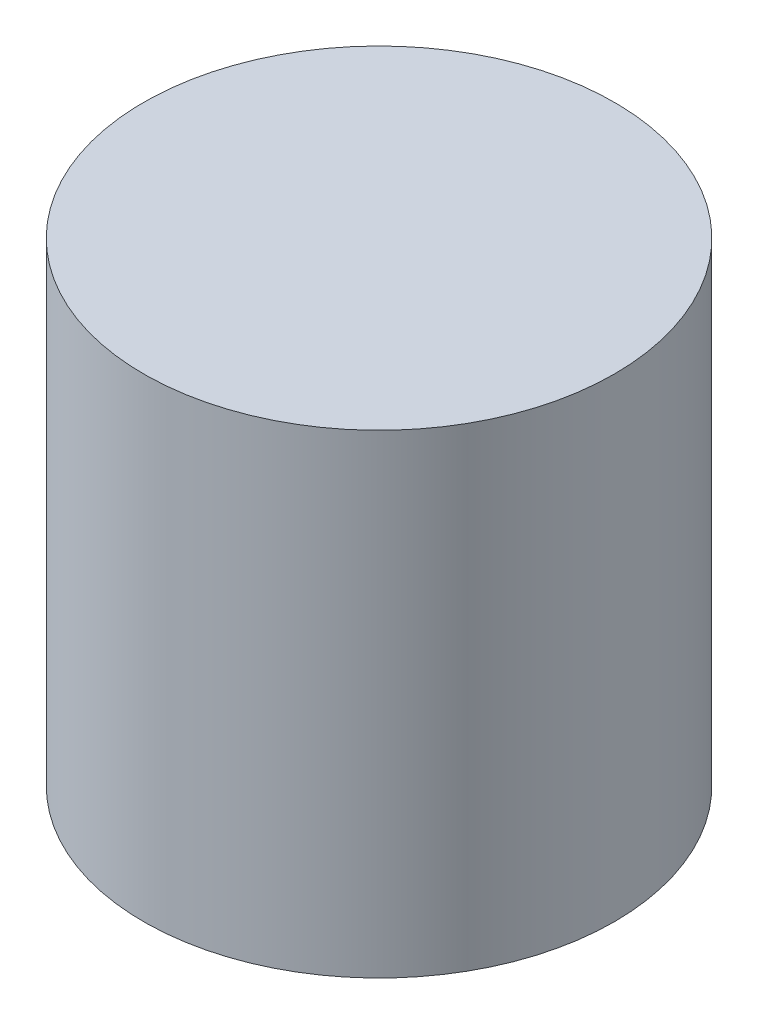
ISO-10303-21;
HEADER;
FILE_DESCRIPTION(('STEP AP214'),'2;1');
FILE_NAME('part.step','',(''),(''),'','','');
FILE_SCHEMA(('AUTOMOTIVE_DESIGN { 1 0 10303 214 1 1 1 1 }'));
ENDSEC;
DATA;
#1=APPLICATION_CONTEXT('core data for automotive mechanical design processes');
#2=APPLICATION_PROTOCOL_DEFINITION('international standard','automotive_design',2000,#1);
#3=PRODUCT_CONTEXT('',#1,'mechanical');
#4=PRODUCT('Part','Part','',(#3));
#5=PRODUCT_RELATED_PRODUCT_CATEGORY('part','',(#4));
#6=PRODUCT_DEFINITION_FORMATION('','',#4);
#7=PRODUCT_DEFINITION_CONTEXT('part definition',#1,'design');
#8=PRODUCT_DEFINITION('design','',#6,#7);
#9=PRODUCT_DEFINITION_SHAPE('','',#8);
#10=(LENGTH_UNIT() NAMED_UNIT(*) SI_UNIT(.MILLI.,.METRE.));
#11=(NAMED_UNIT(*) PLANE_ANGLE_UNIT() SI_UNIT($,.RADIAN.));
#12=(NAMED_UNIT(*) SI_UNIT($,.STERADIAN.) SOLID_ANGLE_UNIT());
#13=UNCERTAINTY_MEASURE_WITH_UNIT(LENGTH_MEASURE(1.E-05),#10,'distance_accuracy_value','');
#14=(GEOMETRIC_REPRESENTATION_CONTEXT(3) GLOBAL_UNCERTAINTY_ASSIGNED_CONTEXT((#13)) GLOBAL_UNIT_ASSIGNED_CONTEXT((#10,
#11,#12)) REPRESENTATION_CONTEXT('',''));
#15=CARTESIAN_POINT('',(0.,0.,0.));
#16=DIRECTION('',(0.,0.,1.));
#17=DIRECTION('',(1.,0.,0.));
#18=AXIS2_PLACEMENT_3D('',#15,#16,#17);
#19=CARTESIAN_POINT('',(0.,44.7210244842766,0.));
#20=DIRECTION('',(0.,-1.,0.));
#21=DIRECTION('',(1.,0.,0.));
#22=AXIS2_PLACEMENT_3D('',#19,#20,#21);
#23=CYLINDRICAL_SURFACE('',#22,12.7);
#24=CARTESIAN_POINT('',(0.,8.80000000000002,0.));
#25=DIRECTION('',(0.,-1.,0.));
#26=DIRECTION('',(1.,0.,0.));
#27=AXIS2_PLACEMENT_3D('',#24,#25,#26);
#28=CIRCLE('',#27,12.7);
#29=CARTESIAN_POINT('',(12.7,8.80000000000003,0.));
#30=VERTEX_POINT('',#29);
#31=EDGE_CURVE('E10',#30,#30,#28,.T.);
#32=ORIENTED_EDGE('',*,*,#31,.T.);
#33=EDGE_LOOP('',(#32));
#34=FACE_BOUND('',#33,.T.);
#35=CARTESIAN_POINT('',(0.,-16.8,0.));
#36=DIRECTION('',(0.,-1.,0.));
#37=DIRECTION('',(1.,0.,0.));
#38=AXIS2_PLACEMENT_3D('',#35,#36,#37);
#39=CIRCLE('',#38,12.7);
#40=CARTESIAN_POINT('',(12.7,-16.8,0.));
#41=VERTEX_POINT('',#40);
#42=EDGE_CURVE('E36',#41,#41,#39,.F.);
#43=ORIENTED_EDGE('',*,*,#42,.T.);
#44=EDGE_LOOP('',(#43));
#45=FACE_BOUND('',#44,.T.);
#46=ADVANCED_FACE('F30',(#34,#45),#23,.T.);
#47=CARTESIAN_POINT('',(4.75574440939042E-12,8.80000000000002,2.48425412185949E-11));
#48=DIRECTION('',(0.,-1.,0.));
#49=DIRECTION('',(0.994749970047276,0.,-0.102335219210899));
#50=AXIS2_PLACEMENT_3D('',#47,#48,#49);
#51=PLANE('',#50);
#52=ORIENTED_EDGE('',*,*,#31,.F.);
#53=EDGE_LOOP('',(#52));
#54=FACE_BOUND('',#53,.T.);
#55=ADVANCED_FACE('F45',(#54),#51,.F.);
#56=CARTESIAN_POINT('',(-194.044505664593,-16.8000000000002,55.8581647343958));
#57=DIRECTION('',(0.,-1.,0.));
#58=DIRECTION('',(-0.994749970047279,0.,0.10233521921087));
#59=AXIS2_PLACEMENT_3D('',#56,#57,#58);
#60=PLANE('',#59);
#61=ORIENTED_EDGE('',*,*,#42,.F.);
#62=EDGE_LOOP('',(#61));
#63=FACE_BOUND('',#62,.T.);
#64=ADVANCED_FACE('F43',(#63),#60,.T.);
#65=CLOSED_SHELL('',(#46,#55,#64));
#66=MANIFOLD_SOLID_BREP('B2',#65);
#67=ADVANCED_BREP_SHAPE_REPRESENTATION('',(#18,#66),#14);
#68=SHAPE_DEFINITION_REPRESENTATION(#9,#67);
ENDSEC;
END-ISO-10303-21;
